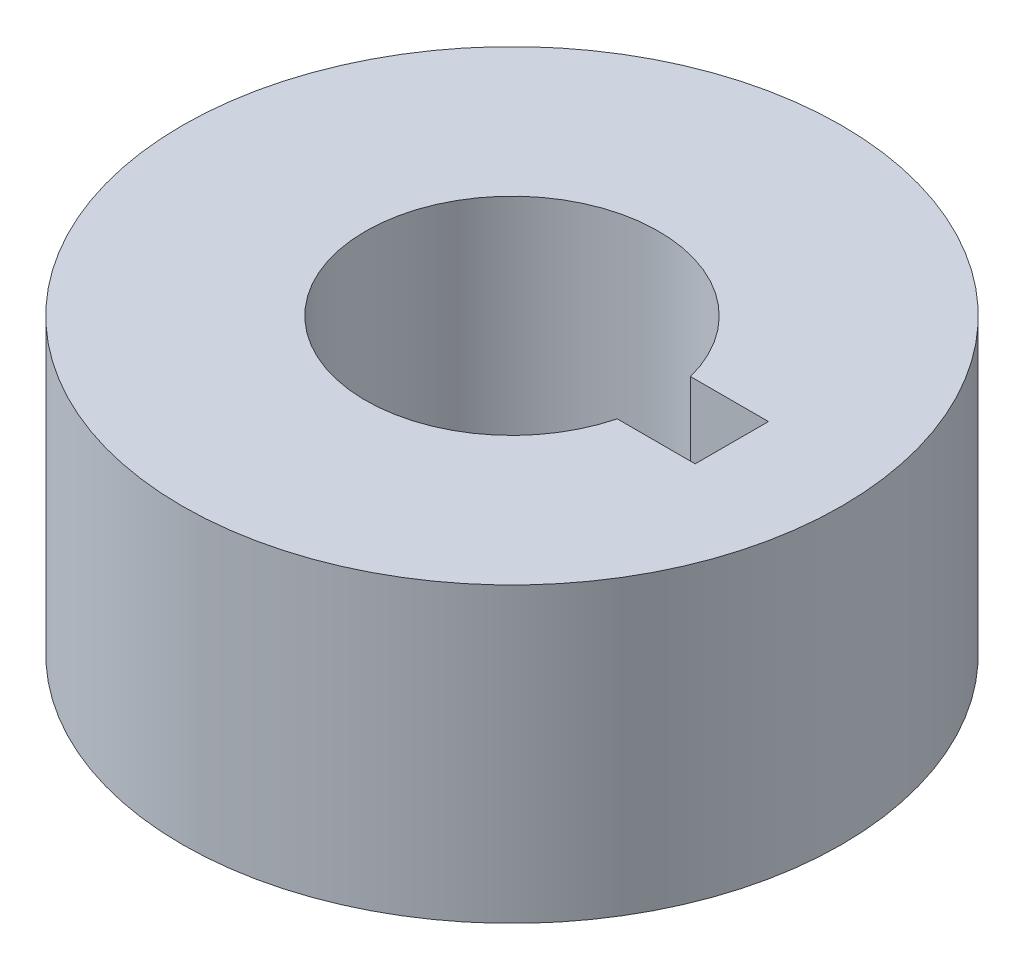
ISO-10303-21;
HEADER;
FILE_DESCRIPTION(('STEP AP214'),'2;1');
FILE_NAME('part.step','',(''),(''),'','','');
FILE_SCHEMA(('AUTOMOTIVE_DESIGN { 1 0 10303 214 1 1 1 1 }'));
ENDSEC;
DATA;
#1=APPLICATION_CONTEXT('core data for automotive mechanical design processes');
#2=APPLICATION_PROTOCOL_DEFINITION('international standard','automotive_design',2000,#1);
#3=PRODUCT_CONTEXT('',#1,'mechanical');
#4=PRODUCT('Part','Part','',(#3));
#5=PRODUCT_RELATED_PRODUCT_CATEGORY('part','',(#4));
#6=PRODUCT_DEFINITION_FORMATION('','',#4);
#7=PRODUCT_DEFINITION_CONTEXT('part definition',#1,'design');
#8=PRODUCT_DEFINITION('design','',#6,#7);
#9=PRODUCT_DEFINITION_SHAPE('','',#8);
#10=(LENGTH_UNIT() NAMED_UNIT(*) SI_UNIT(.MILLI.,.METRE.));
#11=(NAMED_UNIT(*) PLANE_ANGLE_UNIT() SI_UNIT($,.RADIAN.));
#12=(NAMED_UNIT(*) SI_UNIT($,.STERADIAN.) SOLID_ANGLE_UNIT());
#13=UNCERTAINTY_MEASURE_WITH_UNIT(LENGTH_MEASURE(1.E-05),#10,'distance_accuracy_value','');
#14=(GEOMETRIC_REPRESENTATION_CONTEXT(3) GLOBAL_UNCERTAINTY_ASSIGNED_CONTEXT((#13)) GLOBAL_UNIT_ASSIGNED_CONTEXT((#10,
#11,#12)) REPRESENTATION_CONTEXT('',''));
#15=CARTESIAN_POINT('',(0.,0.,0.));
#16=DIRECTION('',(0.,0.,1.));
#17=DIRECTION('',(1.,0.,0.));
#18=AXIS2_PLACEMENT_3D('',#15,#16,#17);
#19=CARTESIAN_POINT('',(0.,20.,0.));
#20=DIRECTION('',(0.,-1.,0.));
#21=DIRECTION('',(0.,0.,-1.));
#22=AXIS2_PLACEMENT_3D('',#19,#20,#21);
#23=CYLINDRICAL_SURFACE('',#22,22.5);
#24=CARTESIAN_POINT('',(0.,20.,0.));
#25=DIRECTION('',(0.,1.,0.));
#26=DIRECTION('',(0.,0.,1.));
#27=AXIS2_PLACEMENT_3D('',#24,#25,#26);
#28=CIRCLE('',#27,22.5);
#29=CARTESIAN_POINT('',(0.,20.,22.5));
#30=VERTEX_POINT('',#29);
#31=EDGE_CURVE('E11',#30,#30,#28,.T.);
#32=ORIENTED_EDGE('',*,*,#31,.F.);
#33=EDGE_LOOP('',(#32));
#34=FACE_BOUND('',#33,.T.);
#35=CARTESIAN_POINT('',(0.,0.,0.));
#36=DIRECTION('',(0.,1.,0.));
#37=DIRECTION('',(0.,0.,1.));
#38=AXIS2_PLACEMENT_3D('',#35,#36,#37);
#39=CIRCLE('',#38,22.5);
#40=CARTESIAN_POINT('',(0.,0.,22.5));
#41=VERTEX_POINT('',#40);
#42=EDGE_CURVE('E36',#41,#41,#39,.T.);
#43=ORIENTED_EDGE('',*,*,#42,.T.);
#44=EDGE_LOOP('',(#43));
#45=FACE_BOUND('',#44,.T.);
#46=ADVANCED_FACE('F33',(#34,#45),#23,.T.);
#47=CARTESIAN_POINT('',(0.,20.,0.));
#48=DIRECTION('',(0.,1.,0.));
#49=DIRECTION('',(0.,0.,1.));
#50=AXIS2_PLACEMENT_3D('',#47,#48,#49);
#51=PLANE('',#50);
#52=CARTESIAN_POINT('',(0.,20.,0.));
#53=DIRECTION('',(0.,1.,0.));
#54=DIRECTION('',(0.,0.,1.));
#55=AXIS2_PLACEMENT_3D('',#52,#53,#54);
#56=CIRCLE('',#55,10.);
#57=CARTESIAN_POINT('',(9.68245836551854,20.,-2.5));
#58=VERTEX_POINT('',#57);
#59=CARTESIAN_POINT('',(9.68245836551854,20.,2.5));
#60=VERTEX_POINT('',#59);
#61=EDGE_CURVE('E47',#58,#60,#56,.T.);
#62=ORIENTED_EDGE('',*,*,#61,.F.);
#63=DIRECTION('',(1.,0.,0.));
#64=VECTOR('',#63,1.);
#65=CARTESIAN_POINT('',(0.,20.,-2.5));
#66=LINE('',#65,#64);
#67=CARTESIAN_POINT('',(15.,20.,-2.5));
#68=VERTEX_POINT('',#67);
#69=EDGE_CURVE('E89',#58,#68,#66,.T.);
#70=ORIENTED_EDGE('',*,*,#69,.T.);
#71=DIRECTION('',(0.,0.,1.));
#72=VECTOR('',#71,1.);
#73=CARTESIAN_POINT('',(15.,20.,0.));
#74=LINE('',#73,#72);
#75=CARTESIAN_POINT('',(15.,20.,2.5));
#76=VERTEX_POINT('',#75);
#77=EDGE_CURVE('E92',#68,#76,#74,.T.);
#78=ORIENTED_EDGE('',*,*,#77,.T.);
#79=DIRECTION('',(1.,0.,0.));
#80=VECTOR('',#79,1.);
#81=CARTESIAN_POINT('',(0.,20.,2.5));
#82=LINE('',#81,#80);
#83=EDGE_CURVE('E98',#60,#76,#82,.T.);
#84=ORIENTED_EDGE('',*,*,#83,.F.);
#85=EDGE_LOOP('',(#62,#70,#78,#84));
#86=FACE_BOUND('',#85,.T.);
#87=ORIENTED_EDGE('',*,*,#31,.T.);
#88=EDGE_LOOP('',(#87));
#89=FACE_BOUND('',#88,.T.);
#90=ADVANCED_FACE('F111',(#86,#89),#51,.T.);
#91=CARTESIAN_POINT('',(0.,0.,0.));
#92=DIRECTION('',(0.,1.,0.));
#93=DIRECTION('',(0.,0.,1.));
#94=AXIS2_PLACEMENT_3D('',#91,#92,#93);
#95=PLANE('',#94);
#96=DIRECTION('',(1.,0.,0.));
#97=VECTOR('',#96,1.);
#98=CARTESIAN_POINT('',(0.,0.,-2.5));
#99=LINE('',#98,#97);
#100=CARTESIAN_POINT('',(9.68245836551854,0.,-2.5));
#101=VERTEX_POINT('',#100);
#102=CARTESIAN_POINT('',(15.,0.,-2.5));
#103=VERTEX_POINT('',#102);
#104=EDGE_CURVE('E78',#101,#103,#99,.T.);
#105=ORIENTED_EDGE('',*,*,#104,.F.);
#106=CARTESIAN_POINT('',(0.,0.,0.));
#107=DIRECTION('',(0.,1.,0.));
#108=DIRECTION('',(0.,0.,1.));
#109=AXIS2_PLACEMENT_3D('',#106,#107,#108);
#110=CIRCLE('',#109,10.);
#111=CARTESIAN_POINT('',(9.68245836551854,0.,2.5));
#112=VERTEX_POINT('',#111);
#113=EDGE_CURVE('E75',#101,#112,#110,.T.);
#114=ORIENTED_EDGE('',*,*,#113,.T.);
#115=DIRECTION('',(1.,0.,0.));
#116=VECTOR('',#115,1.);
#117=CARTESIAN_POINT('',(0.,0.,2.5));
#118=LINE('',#117,#116);
#119=CARTESIAN_POINT('',(15.,0.,2.5));
#120=VERTEX_POINT('',#119);
#121=EDGE_CURVE('E81',#112,#120,#118,.T.);
#122=ORIENTED_EDGE('',*,*,#121,.T.);
#123=DIRECTION('',(0.,0.,1.));
#124=VECTOR('',#123,1.);
#125=CARTESIAN_POINT('',(15.,0.,0.));
#126=LINE('',#125,#124);
#127=EDGE_CURVE('E85',#103,#120,#126,.T.);
#128=ORIENTED_EDGE('',*,*,#127,.F.);
#129=EDGE_LOOP('',(#105,#114,#122,#128));
#130=FACE_BOUND('',#129,.T.);
#131=ORIENTED_EDGE('',*,*,#42,.F.);
#132=EDGE_LOOP('',(#131));
#133=FACE_BOUND('',#132,.T.);
#134=ADVANCED_FACE('F87',(#130,#133),#95,.F.);
#135=CARTESIAN_POINT('',(0.,0.,0.));
#136=DIRECTION('',(0.,1.,0.));
#137=DIRECTION('',(0.,0.,1.));
#138=AXIS2_PLACEMENT_3D('',#135,#136,#137);
#139=CYLINDRICAL_SURFACE('',#138,10.);
#140=ORIENTED_EDGE('',*,*,#61,.T.);
#141=DIRECTION('',(0.,1.,0.));
#142=VECTOR('',#141,1.);
#143=CARTESIAN_POINT('',(9.68245836551854,0.,2.5));
#144=LINE('',#143,#142);
#145=EDGE_CURVE('E72',#112,#60,#144,.T.);
#146=ORIENTED_EDGE('',*,*,#145,.F.);
#147=ORIENTED_EDGE('',*,*,#113,.F.);
#148=DIRECTION('',(0.,1.,0.));
#149=VECTOR('',#148,1.);
#150=CARTESIAN_POINT('',(9.68245836551854,0.,-2.5));
#151=LINE('',#150,#149);
#152=EDGE_CURVE('E102',#101,#58,#151,.T.);
#153=ORIENTED_EDGE('',*,*,#152,.T.);
#154=EDGE_LOOP('',(#140,#146,#147,#153));
#155=FACE_BOUND('',#154,.T.);
#156=ADVANCED_FACE('F73',(#155),#139,.F.);
#157=CARTESIAN_POINT('',(0.,0.,-2.5));
#158=DIRECTION('',(0.,0.,1.));
#159=DIRECTION('',(1.,0.,0.));
#160=AXIS2_PLACEMENT_3D('',#157,#158,#159);
#161=PLANE('',#160);
#162=ORIENTED_EDGE('',*,*,#69,.F.);
#163=ORIENTED_EDGE('',*,*,#152,.F.);
#164=ORIENTED_EDGE('',*,*,#104,.T.);
#165=DIRECTION('',(0.,1.,0.));
#166=VECTOR('',#165,1.);
#167=CARTESIAN_POINT('',(15.,0.,-2.5));
#168=LINE('',#167,#166);
#169=EDGE_CURVE('E104',#103,#68,#168,.T.);
#170=ORIENTED_EDGE('',*,*,#169,.T.);
#171=EDGE_LOOP('',(#162,#163,#164,#170));
#172=FACE_BOUND('',#171,.T.);
#173=ADVANCED_FACE('F115',(#172),#161,.T.);
#174=CARTESIAN_POINT('',(15.,0.,0.));
#175=DIRECTION('',(-1.,0.,0.));
#176=DIRECTION('',(0.,0.,1.));
#177=AXIS2_PLACEMENT_3D('',#174,#175,#176);
#178=PLANE('',#177);
#179=ORIENTED_EDGE('',*,*,#77,.F.);
#180=ORIENTED_EDGE('',*,*,#169,.F.);
#181=ORIENTED_EDGE('',*,*,#127,.T.);
#182=DIRECTION('',(0.,1.,0.));
#183=VECTOR('',#182,1.);
#184=CARTESIAN_POINT('',(15.,0.,2.5));
#185=LINE('',#184,#183);
#186=EDGE_CURVE('E55',#120,#76,#185,.T.);
#187=ORIENTED_EDGE('',*,*,#186,.T.);
#188=EDGE_LOOP('',(#179,#180,#181,#187));
#189=FACE_BOUND('',#188,.T.);
#190=ADVANCED_FACE('F108',(#189),#178,.T.);
#191=CARTESIAN_POINT('',(0.,0.,2.5));
#192=DIRECTION('',(0.,0.,1.));
#193=DIRECTION('',(1.,0.,0.));
#194=AXIS2_PLACEMENT_3D('',#191,#192,#193);
#195=PLANE('',#194);
#196=ORIENTED_EDGE('',*,*,#83,.T.);
#197=ORIENTED_EDGE('',*,*,#186,.F.);
#198=ORIENTED_EDGE('',*,*,#121,.F.);
#199=ORIENTED_EDGE('',*,*,#145,.T.);
#200=EDGE_LOOP('',(#196,#197,#198,#199));
#201=FACE_BOUND('',#200,.T.);
#202=ADVANCED_FACE('F82',(#201),#195,.F.);
#203=CLOSED_SHELL('',(#46,#90,#134,#156,#173,#190,#202));
#204=MANIFOLD_SOLID_BREP('B2',#203);
#205=ADVANCED_BREP_SHAPE_REPRESENTATION('',(#18,#204),#14);
#206=SHAPE_DEFINITION_REPRESENTATION(#9,#205);
ENDSEC;
END-ISO-10303-21;
